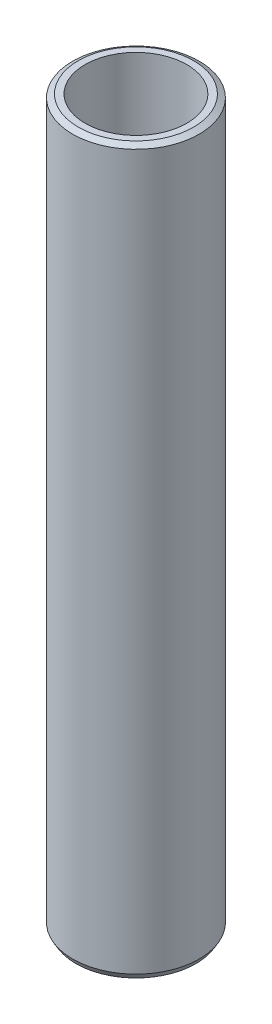
ISO-10303-21;
HEADER;
FILE_DESCRIPTION(('STEP AP214'),'2;1');
FILE_NAME('part.step','',(''),(''),'','','');
FILE_SCHEMA(('AUTOMOTIVE_DESIGN { 1 0 10303 214 1 1 1 1 }'));
ENDSEC;
DATA;
#1=APPLICATION_CONTEXT('core data for automotive mechanical design processes');
#2=APPLICATION_PROTOCOL_DEFINITION('international standard','automotive_design',2000,#1);
#3=PRODUCT_CONTEXT('',#1,'mechanical');
#4=PRODUCT('Part','Part','',(#3));
#5=PRODUCT_RELATED_PRODUCT_CATEGORY('part','',(#4));
#6=PRODUCT_DEFINITION_FORMATION('','',#4);
#7=PRODUCT_DEFINITION_CONTEXT('part definition',#1,'design');
#8=PRODUCT_DEFINITION('design','',#6,#7);
#9=PRODUCT_DEFINITION_SHAPE('','',#8);
#10=(LENGTH_UNIT() NAMED_UNIT(*) SI_UNIT(.MILLI.,.METRE.));
#11=(NAMED_UNIT(*) PLANE_ANGLE_UNIT() SI_UNIT($,.RADIAN.));
#12=(NAMED_UNIT(*) SI_UNIT($,.STERADIAN.) SOLID_ANGLE_UNIT());
#13=UNCERTAINTY_MEASURE_WITH_UNIT(LENGTH_MEASURE(1.E-05),#10,'distance_accuracy_value','');
#14=(GEOMETRIC_REPRESENTATION_CONTEXT(3) GLOBAL_UNCERTAINTY_ASSIGNED_CONTEXT((#13)) GLOBAL_UNIT_ASSIGNED_CONTEXT((#10,
#11,#12)) REPRESENTATION_CONTEXT('',''));
#15=CARTESIAN_POINT('',(0.,0.,0.));
#16=DIRECTION('',(0.,0.,1.));
#17=DIRECTION('',(1.,0.,0.));
#18=AXIS2_PLACEMENT_3D('',#15,#16,#17);
#19=CARTESIAN_POINT('',(0.,600.,0.));
#20=DIRECTION('',(0.,-1.,0.));
#21=DIRECTION('',(0.,0.,-1.));
#22=AXIS2_PLACEMENT_3D('',#19,#20,#21);
#23=CYLINDRICAL_SURFACE('',#22,52.5);
#24=CARTESIAN_POINT('',(0.,597.298324661954,0.));
#25=DIRECTION('',(0.,1.,0.));
#26=DIRECTION('',(0.,0.,1.));
#27=AXIS2_PLACEMENT_3D('',#24,#25,#26);
#28=CIRCLE('',#27,52.5);
#29=CARTESIAN_POINT('',(0.,597.298324661954,52.5));
#30=VERTEX_POINT('',#29);
#31=EDGE_CURVE('E50',#30,#30,#28,.F.);
#32=ORIENTED_EDGE('',*,*,#31,.T.);
#33=EDGE_LOOP('',(#32));
#34=FACE_BOUND('',#33,.T.);
#35=CARTESIAN_POINT('',(0.,4.67943895105172,0.));
#36=DIRECTION('',(0.,1.,0.));
#37=DIRECTION('',(0.,0.,1.));
#38=AXIS2_PLACEMENT_3D('',#35,#36,#37);
#39=CIRCLE('',#38,52.5);
#40=CARTESIAN_POINT('',(0.,4.67943895105172,52.5));
#41=VERTEX_POINT('',#40);
#42=EDGE_CURVE('E51',#41,#41,#39,.T.);
#43=ORIENTED_EDGE('',*,*,#42,.T.);
#44=EDGE_LOOP('',(#43));
#45=FACE_BOUND('',#44,.T.);
#46=ADVANCED_FACE('F39',(#34,#45),#23,.T.);
#47=CARTESIAN_POINT('',(0.,600.,0.));
#48=DIRECTION('',(0.,1.,0.));
#49=DIRECTION('',(0.,0.,1.));
#50=AXIS2_PLACEMENT_3D('',#47,#48,#49);
#51=PLANE('',#50);
#52=CARTESIAN_POINT('',(0.,600.,0.));
#53=DIRECTION('',(0.,1.,0.));
#54=DIRECTION('',(0.,0.,1.));
#55=AXIS2_PLACEMENT_3D('',#52,#53,#54);
#56=CIRCLE('',#55,47.8205610489485);
#57=CARTESIAN_POINT('',(0.,600.,47.8205610489485));
#58=VERTEX_POINT('',#57);
#59=EDGE_CURVE('E54',#58,#58,#56,.T.);
#60=ORIENTED_EDGE('',*,*,#59,.T.);
#61=EDGE_LOOP('',(#60));
#62=FACE_BOUND('',#61,.T.);
#63=CARTESIAN_POINT('',(0.,600.,0.));
#64=DIRECTION('',(0.,1.,0.));
#65=DIRECTION('',(0.,0.,1.));
#66=AXIS2_PLACEMENT_3D('',#63,#64,#65);
#67=CIRCLE('',#66,42.2147530311862);
#68=CARTESIAN_POINT('',(0.,600.,42.2147530311862));
#69=VERTEX_POINT('',#68);
#70=EDGE_CURVE('E58',#69,#69,#67,.T.);
#71=ORIENTED_EDGE('',*,*,#70,.F.);
#72=EDGE_LOOP('',(#71));
#73=FACE_BOUND('',#72,.T.);
#74=ADVANCED_FACE('F69',(#62,#73),#51,.T.);
#75=CARTESIAN_POINT('',(0.,0.,0.));
#76=DIRECTION('',(0.,1.,0.));
#77=DIRECTION('',(0.,0.,1.));
#78=AXIS2_PLACEMENT_3D('',#75,#76,#77);
#79=PLANE('',#78);
#80=CARTESIAN_POINT('',(0.,0.,0.));
#81=DIRECTION('',(0.,1.,0.));
#82=DIRECTION('',(0.,0.,1.));
#83=AXIS2_PLACEMENT_3D('',#80,#81,#82);
#84=CIRCLE('',#83,49.7983246619538);
#85=CARTESIAN_POINT('',(0.,0.,49.7983246619538));
#86=VERTEX_POINT('',#85);
#87=EDGE_CURVE('E10',#86,#86,#84,.F.);
#88=ORIENTED_EDGE('',*,*,#87,.T.);
#89=EDGE_LOOP('',(#88));
#90=FACE_BOUND('',#89,.T.);
#91=CARTESIAN_POINT('',(0.,0.,0.));
#92=DIRECTION('',(0.,1.,0.));
#93=DIRECTION('',(0.,0.,1.));
#94=AXIS2_PLACEMENT_3D('',#91,#92,#93);
#95=CIRCLE('',#94,42.2147530311862);
#96=CARTESIAN_POINT('',(0.,0.,42.2147530311862));
#97=VERTEX_POINT('',#96);
#98=EDGE_CURVE('E63',#97,#97,#95,.T.);
#99=ORIENTED_EDGE('',*,*,#98,.T.);
#100=EDGE_LOOP('',(#99));
#101=FACE_BOUND('',#100,.T.);
#102=ADVANCED_FACE('F75',(#90,#101),#79,.F.);
#103=CARTESIAN_POINT('',(0.,600.,0.));
#104=DIRECTION('',(0.,-1.,0.));
#105=DIRECTION('',(0.,0.,-1.));
#106=AXIS2_PLACEMENT_3D('',#103,#104,#105);
#107=CYLINDRICAL_SURFACE('',#106,42.2147530311862);
#108=ORIENTED_EDGE('',*,*,#70,.T.);
#109=EDGE_LOOP('',(#108));
#110=FACE_BOUND('',#109,.T.);
#111=ORIENTED_EDGE('',*,*,#98,.F.);
#112=EDGE_LOOP('',(#111));
#113=FACE_BOUND('',#112,.T.);
#114=ADVANCED_FACE('F70',(#110,#113),#107,.F.);
#115=CARTESIAN_POINT('',(0.,600.,0.));
#116=DIRECTION('',(0.,-1.,0.));
#117=DIRECTION('',(0.,0.,-1.));
#118=AXIS2_PLACEMENT_3D('',#115,#116,#117);
#119=CONICAL_SURFACE('',#118,47.8205610489485,1.04719755119662);
#120=ORIENTED_EDGE('',*,*,#31,.F.);
#121=EDGE_LOOP('',(#120));
#122=FACE_BOUND('',#121,.T.);
#123=ORIENTED_EDGE('',*,*,#59,.F.);
#124=EDGE_LOOP('',(#123));
#125=FACE_BOUND('',#124,.T.);
#126=ADVANCED_FACE('F81',(#122,#125),#119,.T.);
#127=CARTESIAN_POINT('',(0.,4.67943895105172,0.));
#128=DIRECTION('',(0.,1.,0.));
#129=DIRECTION('',(0.,0.,1.));
#130=AXIS2_PLACEMENT_3D('',#127,#128,#129);
#131=CONICAL_SURFACE('',#130,52.5,0.523598775598305);
#132=ORIENTED_EDGE('',*,*,#87,.F.);
#133=EDGE_LOOP('',(#132));
#134=FACE_BOUND('',#133,.T.);
#135=ORIENTED_EDGE('',*,*,#42,.F.);
#136=EDGE_LOOP('',(#135));
#137=FACE_BOUND('',#136,.T.);
#138=ADVANCED_FACE('F45',(#134,#137),#131,.T.);
#139=CLOSED_SHELL('',(#46,#74,#102,#114,#126,#138));
#140=MANIFOLD_SOLID_BREP('B2',#139);
#141=ADVANCED_BREP_SHAPE_REPRESENTATION('',(#18,#140),#14);
#142=SHAPE_DEFINITION_REPRESENTATION(#9,#141);
ENDSEC;
END-ISO-10303-21;
